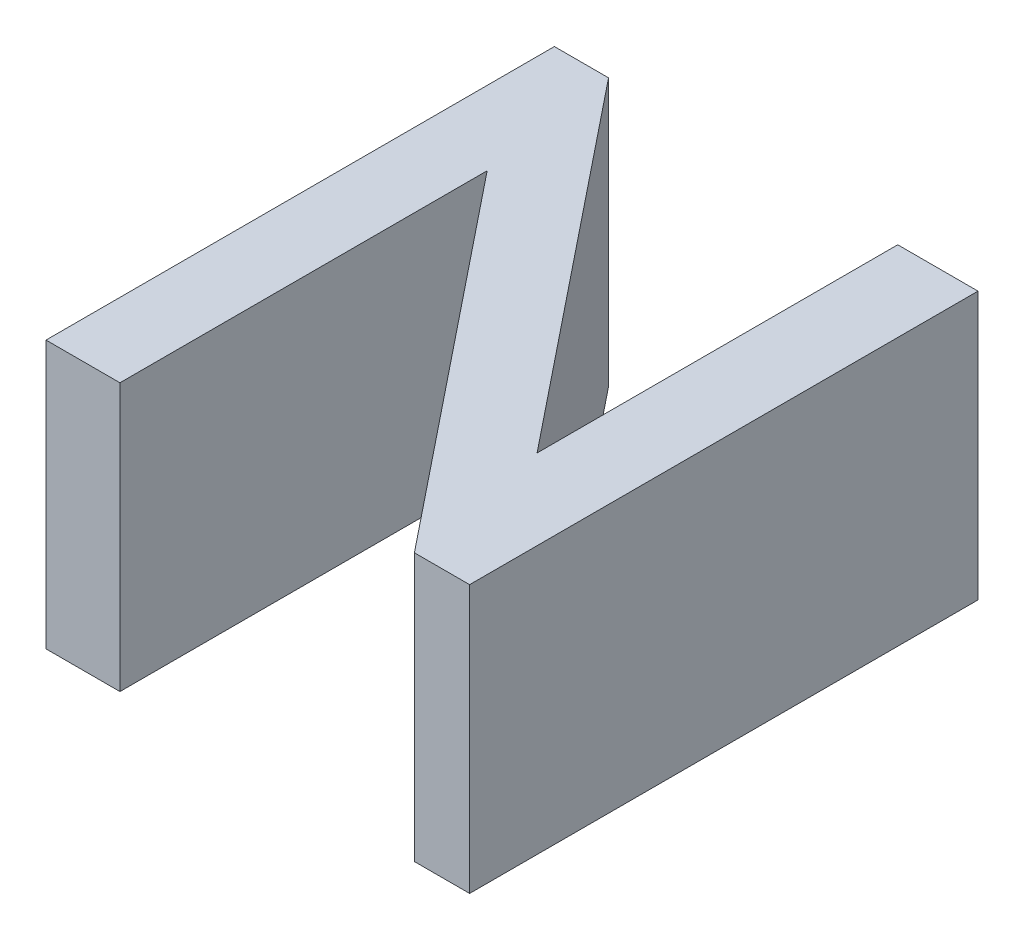
ISO-10303-21;
HEADER;
FILE_DESCRIPTION(('STEP AP214'),'2;1');
FILE_NAME('part.step','',(''),(''),'','','');
FILE_SCHEMA(('AUTOMOTIVE_DESIGN { 1 0 10303 214 1 1 1 1 }'));
ENDSEC;
DATA;
#1=APPLICATION_CONTEXT('core data for automotive mechanical design processes');
#2=APPLICATION_PROTOCOL_DEFINITION('international standard','automotive_design',2000,#1);
#3=PRODUCT_CONTEXT('',#1,'mechanical');
#4=PRODUCT('Part','Part','',(#3));
#5=PRODUCT_RELATED_PRODUCT_CATEGORY('part','',(#4));
#6=PRODUCT_DEFINITION_FORMATION('','',#4);
#7=PRODUCT_DEFINITION_CONTEXT('part definition',#1,'design');
#8=PRODUCT_DEFINITION('design','',#6,#7);
#9=PRODUCT_DEFINITION_SHAPE('','',#8);
#10=(LENGTH_UNIT() NAMED_UNIT(*) SI_UNIT(.MILLI.,.METRE.));
#11=(NAMED_UNIT(*) PLANE_ANGLE_UNIT() SI_UNIT($,.RADIAN.));
#12=(NAMED_UNIT(*) SI_UNIT($,.STERADIAN.) SOLID_ANGLE_UNIT());
#13=UNCERTAINTY_MEASURE_WITH_UNIT(LENGTH_MEASURE(1.E-05),#10,'distance_accuracy_value','');
#14=(GEOMETRIC_REPRESENTATION_CONTEXT(3) GLOBAL_UNCERTAINTY_ASSIGNED_CONTEXT((#13)) GLOBAL_UNIT_ASSIGNED_CONTEXT((#10,
#11,#12)) REPRESENTATION_CONTEXT('',''));
#15=CARTESIAN_POINT('',(0.,0.,0.));
#16=DIRECTION('',(0.,0.,1.));
#17=DIRECTION('',(1.,0.,0.));
#18=AXIS2_PLACEMENT_3D('',#15,#16,#17);
#19=CARTESIAN_POINT('',(89.7152293050329,10.,-70.0192436771193));
#20=DIRECTION('',(-1.,0.,0.));
#21=DIRECTION('',(0.,0.,1.));
#22=AXIS2_PLACEMENT_3D('',#19,#20,#21);
#23=PLANE('',#22);
#24=DIRECTION('',(0.,0.,-1.));
#25=VECTOR('',#24,1.);
#26=CARTESIAN_POINT('',(89.7152293050329,0.,-70.0192436771193));
#27=LINE('',#26,#25);
#28=CARTESIAN_POINT('',(89.7152293050329,0.,-56.28859622837));
#29=VERTEX_POINT('',#28);
#30=CARTESIAN_POINT('',(89.7152293050329,0.,-70.0192436771193));
#31=VERTEX_POINT('',#30);
#32=EDGE_CURVE('E138',#29,#31,#27,.T.);
#33=ORIENTED_EDGE('',*,*,#32,.T.);
#34=DIRECTION('',(0.,-1.,0.));
#35=VECTOR('',#34,1.);
#36=CARTESIAN_POINT('',(89.7152293050329,10.,-70.0192436771193));
#37=LINE('',#36,#35);
#38=CARTESIAN_POINT('',(89.7152293050329,10.,-70.0192436771193));
#39=VERTEX_POINT('',#38);
#40=EDGE_CURVE('E11',#39,#31,#37,.T.);
#41=ORIENTED_EDGE('',*,*,#40,.F.);
#42=DIRECTION('',(0.,0.,-1.));
#43=VECTOR('',#42,1.);
#44=CARTESIAN_POINT('',(89.7152293050329,10.,-70.0192436771193));
#45=LINE('',#44,#43);
#46=CARTESIAN_POINT('',(89.7152293050329,10.,-56.28859622837));
#47=VERTEX_POINT('',#46);
#48=EDGE_CURVE('E156',#47,#39,#45,.T.);
#49=ORIENTED_EDGE('',*,*,#48,.F.);
#50=DIRECTION('',(0.,-1.,0.));
#51=VECTOR('',#50,1.);
#52=CARTESIAN_POINT('',(89.7152293050329,10.,-56.28859622837));
#53=LINE('',#52,#51);
#54=EDGE_CURVE('E134',#47,#29,#53,.T.);
#55=ORIENTED_EDGE('',*,*,#54,.T.);
#56=EDGE_LOOP('',(#33,#41,#49,#55));
#57=FACE_BOUND('',#56,.T.);
#58=ADVANCED_FACE('F30',(#57),#23,.F.);
#59=CARTESIAN_POINT('',(100.725324444613,10.,-56.28859622837));
#60=DIRECTION('',(0.780159396589424,0.,-0.625580782883575));
#61=DIRECTION('',(-0.625580782883575,0.,-0.780159396589424));
#62=AXIS2_PLACEMENT_3D('',#59,#60,#61);
#63=PLANE('',#62);
#64=DIRECTION('',(0.625580782883575,0.,0.780159396589424));
#65=VECTOR('',#64,1.);
#66=CARTESIAN_POINT('',(100.725324444613,0.,-56.28859622837));
#67=LINE('',#66,#65);
#68=CARTESIAN_POINT('',(100.725324444613,0.,-56.28859622837));
#69=VERTEX_POINT('',#68);
#70=EDGE_CURVE('E141',#31,#69,#67,.T.);
#71=ORIENTED_EDGE('',*,*,#70,.T.);
#72=DIRECTION('',(0.,-1.,0.));
#73=VECTOR('',#72,1.);
#74=CARTESIAN_POINT('',(100.725324444613,10.,-56.28859622837));
#75=LINE('',#74,#73);
#76=CARTESIAN_POINT('',(100.725324444613,10.,-56.28859622837));
#77=VERTEX_POINT('',#76);
#78=EDGE_CURVE('E38',#77,#69,#75,.T.);
#79=ORIENTED_EDGE('',*,*,#78,.F.);
#80=DIRECTION('',(0.625580782883575,0.,0.780159396589424));
#81=VECTOR('',#80,1.);
#82=CARTESIAN_POINT('',(100.725324444613,10.,-56.28859622837));
#83=LINE('',#82,#81);
#84=EDGE_CURVE('E95',#39,#77,#83,.T.);
#85=ORIENTED_EDGE('',*,*,#84,.F.);
#86=ORIENTED_EDGE('',*,*,#40,.T.);
#87=EDGE_LOOP('',(#71,#79,#85,#86));
#88=FACE_BOUND('',#87,.T.);
#89=ADVANCED_FACE('F205',(#88),#63,.F.);
#90=CARTESIAN_POINT('',(102.789087737581,10.,-56.28859622837));
#91=DIRECTION('',(0.,0.,-1.));
#92=DIRECTION('',(-1.,0.,0.));
#93=AXIS2_PLACEMENT_3D('',#90,#91,#92);
#94=PLANE('',#93);
#95=DIRECTION('',(1.,0.,0.));
#96=VECTOR('',#95,1.);
#97=CARTESIAN_POINT('',(102.789087737581,0.,-56.28859622837));
#98=LINE('',#97,#96);
#99=CARTESIAN_POINT('',(102.789087737581,0.,-56.28859622837));
#100=VERTEX_POINT('',#99);
#101=EDGE_CURVE('E143',#69,#100,#98,.T.);
#102=ORIENTED_EDGE('',*,*,#101,.T.);
#103=DIRECTION('',(0.,-1.,0.));
#104=VECTOR('',#103,1.);
#105=CARTESIAN_POINT('',(102.789087737581,10.,-56.28859622837));
#106=LINE('',#105,#104);
#107=CARTESIAN_POINT('',(102.789087737581,10.,-56.28859622837));
#108=VERTEX_POINT('',#107);
#109=EDGE_CURVE('E169',#108,#100,#106,.T.);
#110=ORIENTED_EDGE('',*,*,#109,.F.);
#111=DIRECTION('',(1.,0.,0.));
#112=VECTOR('',#111,1.);
#113=CARTESIAN_POINT('',(102.789087737581,10.,-56.28859622837));
#114=LINE('',#113,#112);
#115=EDGE_CURVE('E177',#77,#108,#114,.T.);
#116=ORIENTED_EDGE('',*,*,#115,.F.);
#117=ORIENTED_EDGE('',*,*,#78,.T.);
#118=EDGE_LOOP('',(#102,#110,#116,#117));
#119=FACE_BOUND('',#118,.T.);
#120=ADVANCED_FACE('F175',(#119),#94,.F.);
#121=CARTESIAN_POINT('',(102.789087737581,10.,-75.2974570796293));
#122=DIRECTION('',(-1.,0.,0.));
#123=DIRECTION('',(0.,0.,1.));
#124=AXIS2_PLACEMENT_3D('',#121,#122,#123);
#125=PLANE('',#124);
#126=DIRECTION('',(0.,0.,-1.));
#127=VECTOR('',#126,1.);
#128=CARTESIAN_POINT('',(102.789087737581,0.,-75.2974570796293));
#129=LINE('',#128,#127);
#130=CARTESIAN_POINT('',(102.789087737581,0.,-75.2974570796293));
#131=VERTEX_POINT('',#130);
#132=EDGE_CURVE('E145',#100,#131,#129,.T.);
#133=ORIENTED_EDGE('',*,*,#132,.T.);
#134=DIRECTION('',(0.,-1.,0.));
#135=VECTOR('',#134,1.);
#136=CARTESIAN_POINT('',(102.789087737581,10.,-75.2974570796293));
#137=LINE('',#136,#135);
#138=CARTESIAN_POINT('',(102.789087737581,10.,-75.2974570796293));
#139=VERTEX_POINT('',#138);
#140=EDGE_CURVE('E166',#139,#131,#137,.T.);
#141=ORIENTED_EDGE('',*,*,#140,.F.);
#142=DIRECTION('',(0.,0.,-1.));
#143=VECTOR('',#142,1.);
#144=CARTESIAN_POINT('',(102.789087737581,10.,-75.2974570796293));
#145=LINE('',#144,#143);
#146=EDGE_CURVE('E195',#108,#139,#145,.T.);
#147=ORIENTED_EDGE('',*,*,#146,.F.);
#148=ORIENTED_EDGE('',*,*,#109,.T.);
#149=EDGE_LOOP('',(#133,#141,#147,#148));
#150=FACE_BOUND('',#149,.T.);
#151=ADVANCED_FACE('F186',(#150),#125,.F.);
#152=CARTESIAN_POINT('',(99.7872445896712,10.,-75.2974570796293));
#153=DIRECTION('',(0.,0.,1.));
#154=DIRECTION('',(1.,0.,0.));
#155=AXIS2_PLACEMENT_3D('',#152,#153,#154);
#156=PLANE('',#155);
#157=DIRECTION('',(-1.,0.,0.));
#158=VECTOR('',#157,1.);
#159=CARTESIAN_POINT('',(99.7872445896712,0.,-75.2974570796293));
#160=LINE('',#159,#158);
#161=CARTESIAN_POINT('',(99.7872445896712,0.,-75.2974570796293));
#162=VERTEX_POINT('',#161);
#163=EDGE_CURVE('E147',#131,#162,#160,.T.);
#164=ORIENTED_EDGE('',*,*,#163,.T.);
#165=DIRECTION('',(0.,-1.,0.));
#166=VECTOR('',#165,1.);
#167=CARTESIAN_POINT('',(99.7872445896712,10.,-75.2974570796293));
#168=LINE('',#167,#166);
#169=CARTESIAN_POINT('',(99.7872445896712,10.,-75.2974570796293));
#170=VERTEX_POINT('',#169);
#171=EDGE_CURVE('E163',#170,#162,#168,.T.);
#172=ORIENTED_EDGE('',*,*,#171,.F.);
#173=DIRECTION('',(-1.,0.,0.));
#174=VECTOR('',#173,1.);
#175=CARTESIAN_POINT('',(99.7872445896712,10.,-75.2974570796293));
#176=LINE('',#175,#174);
#177=EDGE_CURVE('E192',#139,#170,#176,.T.);
#178=ORIENTED_EDGE('',*,*,#177,.F.);
#179=ORIENTED_EDGE('',*,*,#140,.T.);
#180=EDGE_LOOP('',(#164,#172,#178,#179));
#181=FACE_BOUND('',#180,.T.);
#182=ADVANCED_FACE('F190',(#181),#156,.F.);
#183=CARTESIAN_POINT('',(99.7872445896712,10.,-61.8130992712162));
#184=DIRECTION('',(1.,0.,0.));
#185=DIRECTION('',(0.,0.,-1.));
#186=AXIS2_PLACEMENT_3D('',#183,#184,#185);
#187=PLANE('',#186);
#188=DIRECTION('',(0.,0.,1.));
#189=VECTOR('',#188,1.);
#190=CARTESIAN_POINT('',(99.7872445896712,0.,-61.8130992712162));
#191=LINE('',#190,#189);
#192=CARTESIAN_POINT('',(99.7872445896712,0.,-61.8130992712162));
#193=VERTEX_POINT('',#192);
#194=EDGE_CURVE('E149',#162,#193,#191,.T.);
#195=ORIENTED_EDGE('',*,*,#194,.T.);
#196=DIRECTION('',(0.,-1.,0.));
#197=VECTOR('',#196,1.);
#198=CARTESIAN_POINT('',(99.7872445896712,10.,-61.8130992712162));
#199=LINE('',#198,#197);
#200=CARTESIAN_POINT('',(99.7872445896712,10.,-61.8130992712162));
#201=VERTEX_POINT('',#200);
#202=EDGE_CURVE('E160',#201,#193,#199,.T.);
#203=ORIENTED_EDGE('',*,*,#202,.F.);
#204=DIRECTION('',(0.,0.,1.));
#205=VECTOR('',#204,1.);
#206=CARTESIAN_POINT('',(99.7872445896712,10.,-61.8130992712162));
#207=LINE('',#206,#205);
#208=EDGE_CURVE('E194',#170,#201,#207,.T.);
#209=ORIENTED_EDGE('',*,*,#208,.F.);
#210=ORIENTED_EDGE('',*,*,#171,.T.);
#211=EDGE_LOOP('',(#195,#203,#209,#210));
#212=FACE_BOUND('',#211,.T.);
#213=ADVANCED_FACE('F217',(#212),#187,.F.);
#214=CARTESIAN_POINT('',(88.9746399458683,10.,-75.2974570796293));
#215=DIRECTION('',(-0.780159396589424,0.,0.625580782883575));
#216=DIRECTION('',(0.625580782883575,0.,0.780159396589424));
#217=AXIS2_PLACEMENT_3D('',#214,#215,#216);
#218=PLANE('',#217);
#219=DIRECTION('',(-0.625580782883575,0.,-0.780159396589424));
#220=VECTOR('',#219,1.);
#221=CARTESIAN_POINT('',(88.9746399458683,0.,-75.2974570796293));
#222=LINE('',#221,#220);
#223=CARTESIAN_POINT('',(88.9746399458683,0.,-75.2974570796293));
#224=VERTEX_POINT('',#223);
#225=EDGE_CURVE('E151',#193,#224,#222,.T.);
#226=ORIENTED_EDGE('',*,*,#225,.T.);
#227=DIRECTION('',(0.,-1.,0.));
#228=VECTOR('',#227,1.);
#229=CARTESIAN_POINT('',(88.9746399458683,10.,-75.2974570796293));
#230=LINE('',#229,#228);
#231=CARTESIAN_POINT('',(88.9746399458683,10.,-75.2974570796293));
#232=VERTEX_POINT('',#231);
#233=EDGE_CURVE('E129',#232,#224,#230,.T.);
#234=ORIENTED_EDGE('',*,*,#233,.F.);
#235=DIRECTION('',(-0.625580782883575,0.,-0.780159396589424));
#236=VECTOR('',#235,1.);
#237=CARTESIAN_POINT('',(88.9746399458683,10.,-75.2974570796293));
#238=LINE('',#237,#236);
#239=EDGE_CURVE('E120',#201,#232,#238,.T.);
#240=ORIENTED_EDGE('',*,*,#239,.F.);
#241=ORIENTED_EDGE('',*,*,#202,.T.);
#242=EDGE_LOOP('',(#226,#234,#240,#241));
#243=FACE_BOUND('',#242,.T.);
#244=ADVANCED_FACE('F220',(#243),#218,.F.);
#245=CARTESIAN_POINT('',(86.9503623641518,10.,-75.2974570796293));
#246=DIRECTION('',(0.,0.,1.));
#247=DIRECTION('',(1.,0.,0.));
#248=AXIS2_PLACEMENT_3D('',#245,#246,#247);
#249=PLANE('',#248);
#250=DIRECTION('',(-1.,0.,0.));
#251=VECTOR('',#250,1.);
#252=CARTESIAN_POINT('',(86.9503623641518,0.,-75.2974570796293));
#253=LINE('',#252,#251);
#254=CARTESIAN_POINT('',(86.9503623641518,0.,-75.2974570796293));
#255=VERTEX_POINT('',#254);
#256=EDGE_CURVE('E128',#224,#255,#253,.T.);
#257=ORIENTED_EDGE('',*,*,#256,.T.);
#258=DIRECTION('',(0.,-1.,0.));
#259=VECTOR('',#258,1.);
#260=CARTESIAN_POINT('',(86.9503623641518,10.,-75.2974570796293));
#261=LINE('',#260,#259);
#262=CARTESIAN_POINT('',(86.9503623641518,10.,-75.2974570796293));
#263=VERTEX_POINT('',#262);
#264=EDGE_CURVE('E125',#263,#255,#261,.T.);
#265=ORIENTED_EDGE('',*,*,#264,.F.);
#266=DIRECTION('',(-1.,0.,0.));
#267=VECTOR('',#266,1.);
#268=CARTESIAN_POINT('',(86.9503623641518,10.,-75.2974570796293));
#269=LINE('',#268,#267);
#270=EDGE_CURVE('E114',#232,#263,#269,.T.);
#271=ORIENTED_EDGE('',*,*,#270,.F.);
#272=ORIENTED_EDGE('',*,*,#233,.T.);
#273=EDGE_LOOP('',(#257,#265,#271,#272));
#274=FACE_BOUND('',#273,.T.);
#275=ADVANCED_FACE('F126',(#274),#249,.F.);
#276=CARTESIAN_POINT('',(86.9503623641518,10.,-56.28859622837));
#277=DIRECTION('',(1.,0.,0.));
#278=DIRECTION('',(0.,0.,-1.));
#279=AXIS2_PLACEMENT_3D('',#276,#277,#278);
#280=PLANE('',#279);
#281=DIRECTION('',(0.,0.,1.));
#282=VECTOR('',#281,1.);
#283=CARTESIAN_POINT('',(86.9503623641518,0.,-56.28859622837));
#284=LINE('',#283,#282);
#285=CARTESIAN_POINT('',(86.9503623641518,0.,-56.28859622837));
#286=VERTEX_POINT('',#285);
#287=EDGE_CURVE('E81',#255,#286,#284,.T.);
#288=ORIENTED_EDGE('',*,*,#287,.T.);
#289=DIRECTION('',(0.,-1.,0.));
#290=VECTOR('',#289,1.);
#291=CARTESIAN_POINT('',(86.9503623641518,10.,-56.28859622837));
#292=LINE('',#291,#290);
#293=CARTESIAN_POINT('',(86.9503623641518,10.,-56.28859622837));
#294=VERTEX_POINT('',#293);
#295=EDGE_CURVE('E130',#294,#286,#292,.T.);
#296=ORIENTED_EDGE('',*,*,#295,.F.);
#297=DIRECTION('',(0.,0.,1.));
#298=VECTOR('',#297,1.);
#299=CARTESIAN_POINT('',(86.9503623641518,10.,-56.28859622837));
#300=LINE('',#299,#298);
#301=EDGE_CURVE('E118',#263,#294,#300,.T.);
#302=ORIENTED_EDGE('',*,*,#301,.F.);
#303=ORIENTED_EDGE('',*,*,#264,.T.);
#304=EDGE_LOOP('',(#288,#296,#302,#303));
#305=FACE_BOUND('',#304,.T.);
#306=ADVANCED_FACE('F132',(#305),#280,.F.);
#307=CARTESIAN_POINT('',(89.7152293050329,10.,-56.28859622837));
#308=DIRECTION('',(0.,0.,-1.));
#309=DIRECTION('',(-1.,0.,0.));
#310=AXIS2_PLACEMENT_3D('',#307,#308,#309);
#311=PLANE('',#310);
#312=DIRECTION('',(1.,0.,0.));
#313=VECTOR('',#312,1.);
#314=CARTESIAN_POINT('',(89.7152293050329,0.,-56.28859622837));
#315=LINE('',#314,#313);
#316=EDGE_CURVE('E87',#286,#29,#315,.T.);
#317=ORIENTED_EDGE('',*,*,#316,.T.);
#318=ORIENTED_EDGE('',*,*,#54,.F.);
#319=DIRECTION('',(1.,0.,0.));
#320=VECTOR('',#319,1.);
#321=CARTESIAN_POINT('',(89.7152293050329,10.,-56.28859622837));
#322=LINE('',#321,#320);
#323=EDGE_CURVE('E46',#294,#47,#322,.T.);
#324=ORIENTED_EDGE('',*,*,#323,.F.);
#325=ORIENTED_EDGE('',*,*,#295,.T.);
#326=EDGE_LOOP('',(#317,#318,#324,#325));
#327=FACE_BOUND('',#326,.T.);
#328=ADVANCED_FACE('F229',(#327),#311,.F.);
#329=CARTESIAN_POINT('',(0.,10.,0.));
#330=DIRECTION('',(0.,-1.,0.));
#331=DIRECTION('',(0.,0.,-1.));
#332=AXIS2_PLACEMENT_3D('',#329,#330,#331);
#333=PLANE('',#332);
#334=ORIENTED_EDGE('',*,*,#48,.T.);
#335=ORIENTED_EDGE('',*,*,#84,.T.);
#336=ORIENTED_EDGE('',*,*,#115,.T.);
#337=ORIENTED_EDGE('',*,*,#146,.T.);
#338=ORIENTED_EDGE('',*,*,#177,.T.);
#339=ORIENTED_EDGE('',*,*,#208,.T.);
#340=ORIENTED_EDGE('',*,*,#239,.T.);
#341=ORIENTED_EDGE('',*,*,#270,.T.);
#342=ORIENTED_EDGE('',*,*,#301,.T.);
#343=ORIENTED_EDGE('',*,*,#323,.T.);
#344=EDGE_LOOP('',(#334,#335,#336,#337,#338,#339,#340,#341,#342,#343));
#345=FACE_BOUND('',#344,.T.);
#346=ADVANCED_FACE('F116',(#345),#333,.F.);
#347=CARTESIAN_POINT('',(0.,0.,0.));
#348=DIRECTION('',(0.,-1.,0.));
#349=DIRECTION('',(0.,0.,-1.));
#350=AXIS2_PLACEMENT_3D('',#347,#348,#349);
#351=PLANE('',#350);
#352=ORIENTED_EDGE('',*,*,#32,.F.);
#353=ORIENTED_EDGE('',*,*,#316,.F.);
#354=ORIENTED_EDGE('',*,*,#287,.F.);
#355=ORIENTED_EDGE('',*,*,#256,.F.);
#356=ORIENTED_EDGE('',*,*,#225,.F.);
#357=ORIENTED_EDGE('',*,*,#194,.F.);
#358=ORIENTED_EDGE('',*,*,#163,.F.);
#359=ORIENTED_EDGE('',*,*,#132,.F.);
#360=ORIENTED_EDGE('',*,*,#101,.F.);
#361=ORIENTED_EDGE('',*,*,#70,.F.);
#362=EDGE_LOOP('',(#352,#353,#354,#355,#356,#357,#358,#359,#360,#361));
#363=FACE_BOUND('',#362,.T.);
#364=ADVANCED_FACE('F181',(#363),#351,.T.);
#365=CLOSED_SHELL('',(#58,#89,#120,#151,#182,#213,#244,#275,#306,#328,#346,#364));
#366=MANIFOLD_SOLID_BREP('B2',#365);
#367=ADVANCED_BREP_SHAPE_REPRESENTATION('',(#18,#366),#14);
#368=SHAPE_DEFINITION_REPRESENTATION(#9,#367);
ENDSEC;
END-ISO-10303-21;
